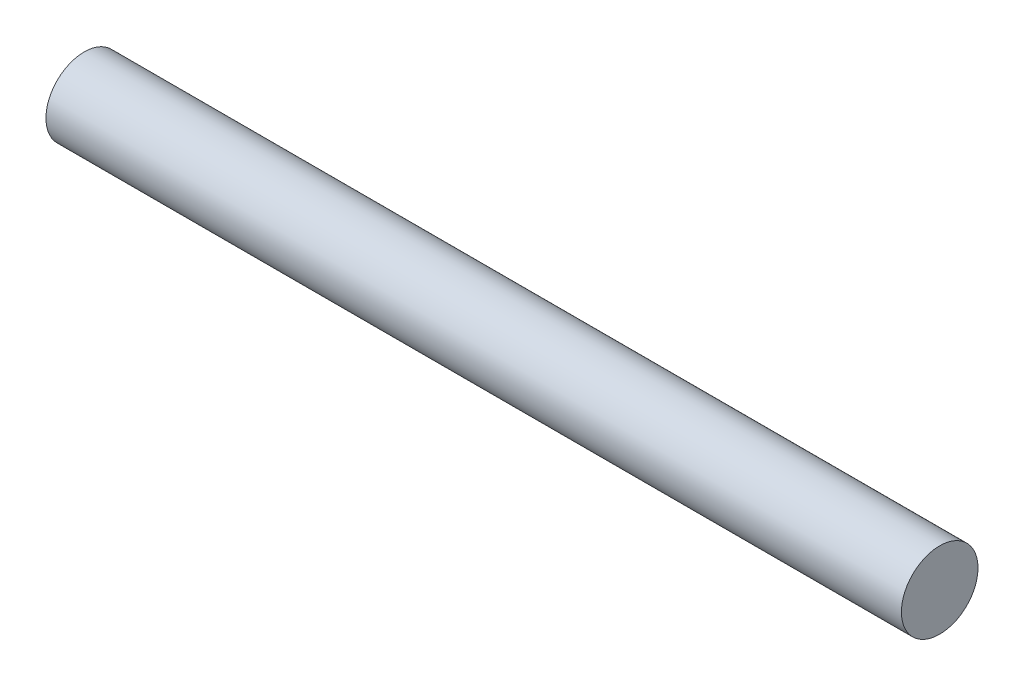
ISO-10303-21;
HEADER;
FILE_DESCRIPTION(('STEP AP214'),'2;1');
FILE_NAME('part.step','',(''),(''),'','','');
FILE_SCHEMA(('AUTOMOTIVE_DESIGN { 1 0 10303 214 1 1 1 1 }'));
ENDSEC;
DATA;
#1=APPLICATION_CONTEXT('core data for automotive mechanical design processes');
#2=APPLICATION_PROTOCOL_DEFINITION('international standard','automotive_design',2000,#1);
#3=PRODUCT_CONTEXT('',#1,'mechanical');
#4=PRODUCT('Part','Part','',(#3));
#5=PRODUCT_RELATED_PRODUCT_CATEGORY('part','',(#4));
#6=PRODUCT_DEFINITION_FORMATION('','',#4);
#7=PRODUCT_DEFINITION_CONTEXT('part definition',#1,'design');
#8=PRODUCT_DEFINITION('design','',#6,#7);
#9=PRODUCT_DEFINITION_SHAPE('','',#8);
#10=(LENGTH_UNIT() NAMED_UNIT(*) SI_UNIT(.MILLI.,.METRE.));
#11=(NAMED_UNIT(*) PLANE_ANGLE_UNIT() SI_UNIT($,.RADIAN.));
#12=(NAMED_UNIT(*) SI_UNIT($,.STERADIAN.) SOLID_ANGLE_UNIT());
#13=UNCERTAINTY_MEASURE_WITH_UNIT(LENGTH_MEASURE(1.E-05),#10,'distance_accuracy_value','');
#14=(GEOMETRIC_REPRESENTATION_CONTEXT(3) GLOBAL_UNCERTAINTY_ASSIGNED_CONTEXT((#13)) GLOBAL_UNIT_ASSIGNED_CONTEXT((#10,
#11,#12)) REPRESENTATION_CONTEXT('',''));
#15=CARTESIAN_POINT('',(0.,0.,0.));
#16=DIRECTION('',(0.,0.,1.));
#17=DIRECTION('',(1.,0.,0.));
#18=AXIS2_PLACEMENT_3D('',#15,#16,#17);
#19=CARTESIAN_POINT('',(106.3625,0.,0.));
#20=DIRECTION('',(-1.,0.,0.));
#21=DIRECTION('',(0.,0.,1.));
#22=AXIS2_PLACEMENT_3D('',#19,#20,#21);
#23=CYLINDRICAL_SURFACE('',#22,9.525);
#24=CARTESIAN_POINT('',(106.3625,0.,0.));
#25=DIRECTION('',(1.,0.,0.));
#26=DIRECTION('',(0.,0.,-1.));
#27=AXIS2_PLACEMENT_3D('',#24,#25,#26);
#28=CIRCLE('',#27,9.525);
#29=CARTESIAN_POINT('',(106.3625,0.,-9.525));
#30=VERTEX_POINT('',#29);
#31=EDGE_CURVE('E10',#30,#30,#28,.T.);
#32=ORIENTED_EDGE('',*,*,#31,.F.);
#33=EDGE_LOOP('',(#32));
#34=FACE_BOUND('',#33,.T.);
#35=CARTESIAN_POINT('',(-106.3625,0.,0.));
#36=DIRECTION('',(1.,0.,0.));
#37=DIRECTION('',(0.,0.,-1.));
#38=AXIS2_PLACEMENT_3D('',#35,#36,#37);
#39=CIRCLE('',#38,9.525);
#40=CARTESIAN_POINT('',(-106.3625,0.,-9.525));
#41=VERTEX_POINT('',#40);
#42=EDGE_CURVE('E33',#41,#41,#39,.T.);
#43=ORIENTED_EDGE('',*,*,#42,.T.);
#44=EDGE_LOOP('',(#43));
#45=FACE_BOUND('',#44,.T.);
#46=ADVANCED_FACE('F30',(#34,#45),#23,.T.);
#47=CARTESIAN_POINT('',(106.3625,0.,0.));
#48=DIRECTION('',(1.,0.,0.));
#49=DIRECTION('',(0.,0.,-1.));
#50=AXIS2_PLACEMENT_3D('',#47,#48,#49);
#51=PLANE('',#50);
#52=ORIENTED_EDGE('',*,*,#31,.T.);
#53=EDGE_LOOP('',(#52));
#54=FACE_BOUND('',#53,.T.);
#55=ADVANCED_FACE('F45',(#54),#51,.T.);
#56=CARTESIAN_POINT('',(-106.3625,0.,0.));
#57=DIRECTION('',(1.,0.,0.));
#58=DIRECTION('',(0.,0.,-1.));
#59=AXIS2_PLACEMENT_3D('',#56,#57,#58);
#60=PLANE('',#59);
#61=ORIENTED_EDGE('',*,*,#42,.F.);
#62=EDGE_LOOP('',(#61));
#63=FACE_BOUND('',#62,.T.);
#64=ADVANCED_FACE('F43',(#63),#60,.F.);
#65=CLOSED_SHELL('',(#46,#55,#64));
#66=MANIFOLD_SOLID_BREP('B2',#65);
#67=ADVANCED_BREP_SHAPE_REPRESENTATION('',(#18,#66),#14);
#68=SHAPE_DEFINITION_REPRESENTATION(#9,#67);
ENDSEC;
END-ISO-10303-21;
